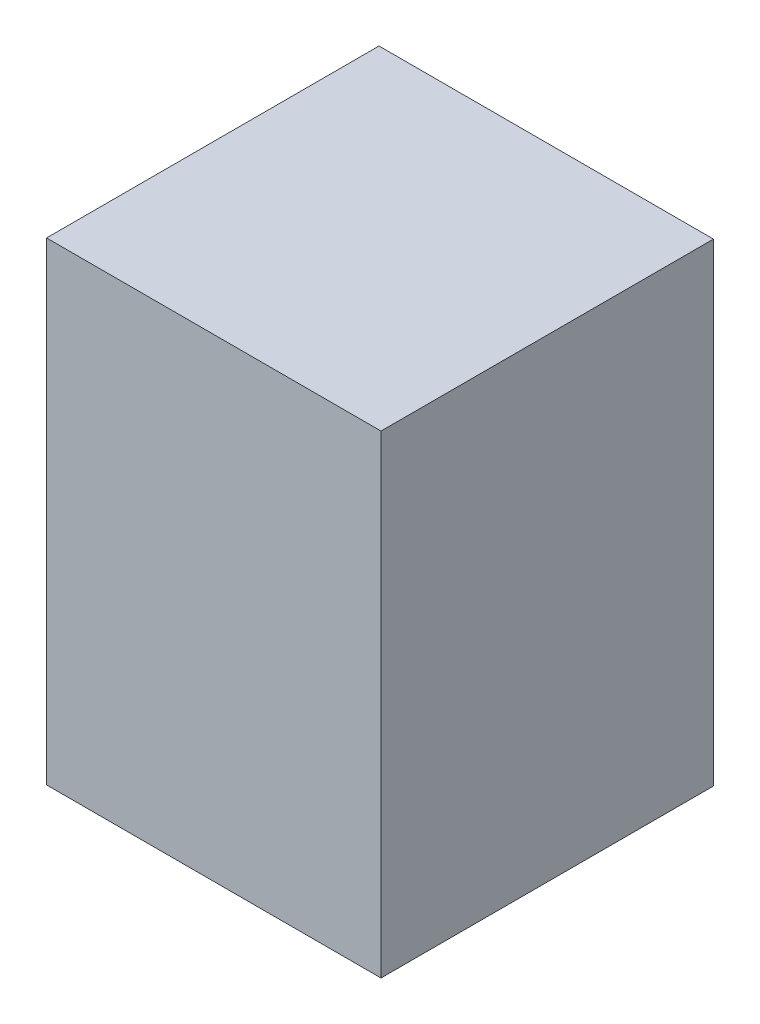
ISO-10303-21;
HEADER;
FILE_DESCRIPTION(('STEP AP214'),'2;1');
FILE_NAME('part.step','',(''),(''),'','','');
FILE_SCHEMA(('AUTOMOTIVE_DESIGN { 1 0 10303 214 1 1 1 1 }'));
ENDSEC;
DATA;
#1=APPLICATION_CONTEXT('core data for automotive mechanical design processes');
#2=APPLICATION_PROTOCOL_DEFINITION('international standard','automotive_design',2000,#1);
#3=PRODUCT_CONTEXT('',#1,'mechanical');
#4=PRODUCT('Part','Part','',(#3));
#5=PRODUCT_RELATED_PRODUCT_CATEGORY('part','',(#4));
#6=PRODUCT_DEFINITION_FORMATION('','',#4);
#7=PRODUCT_DEFINITION_CONTEXT('part definition',#1,'design');
#8=PRODUCT_DEFINITION('design','',#6,#7);
#9=PRODUCT_DEFINITION_SHAPE('','',#8);
#10=(LENGTH_UNIT() NAMED_UNIT(*) SI_UNIT(.MILLI.,.METRE.));
#11=(NAMED_UNIT(*) PLANE_ANGLE_UNIT() SI_UNIT($,.RADIAN.));
#12=(NAMED_UNIT(*) SI_UNIT($,.STERADIAN.) SOLID_ANGLE_UNIT());
#13=UNCERTAINTY_MEASURE_WITH_UNIT(LENGTH_MEASURE(1.E-05),#10,'distance_accuracy_value','');
#14=(GEOMETRIC_REPRESENTATION_CONTEXT(3) GLOBAL_UNCERTAINTY_ASSIGNED_CONTEXT((#13)) GLOBAL_UNIT_ASSIGNED_CONTEXT((#10,
#11,#12)) REPRESENTATION_CONTEXT('',''));
#15=CARTESIAN_POINT('',(0.,0.,0.));
#16=DIRECTION('',(0.,0.,1.));
#17=DIRECTION('',(1.,0.,0.));
#18=AXIS2_PLACEMENT_3D('',#15,#16,#17);
#19=CARTESIAN_POINT('',(-0.4023995,0.56994298,0.80000094));
#20=DIRECTION('',(0.,0.,-1.));
#21=DIRECTION('',(0.,-1.,0.));
#22=AXIS2_PLACEMENT_3D('',#19,#20,#21);
#23=PLANE('',#22);
#24=DIRECTION('',(0.,-1.,0.));
#25=VECTOR('',#24,1.);
#26=CARTESIAN_POINT('',(-0.4023995,0.56994298,0.80000094));
#27=LINE('',#26,#25);
#28=CARTESIAN_POINT('',(-0.4023995,0.56994298,0.80000094));
#29=VERTEX_POINT('',#28);
#30=CARTESIAN_POINT('',(-0.4023995,-0.56994298,0.80000094));
#31=VERTEX_POINT('',#30);
#32=EDGE_CURVE('E90',#29,#31,#27,.T.);
#33=ORIENTED_EDGE('',*,*,#32,.T.);
#34=DIRECTION('',(1.,0.,0.));
#35=VECTOR('',#34,1.);
#36=CARTESIAN_POINT('',(-0.4023995,-0.56994298,0.80000094));
#37=LINE('',#36,#35);
#38=CARTESIAN_POINT('',(0.4023995,-0.56994298,0.80000094));
#39=VERTEX_POINT('',#38);
#40=EDGE_CURVE('E85',#31,#39,#37,.T.);
#41=ORIENTED_EDGE('',*,*,#40,.T.);
#42=DIRECTION('',(0.,1.,0.));
#43=VECTOR('',#42,1.);
#44=CARTESIAN_POINT('',(0.4023995,-0.56994298,0.80000094));
#45=LINE('',#44,#43);
#46=CARTESIAN_POINT('',(0.4023995,0.56994298,0.80000094));
#47=VERTEX_POINT('',#46);
#48=EDGE_CURVE('E19',#39,#47,#45,.T.);
#49=ORIENTED_EDGE('',*,*,#48,.T.);
#50=DIRECTION('',(-1.,0.,0.));
#51=VECTOR('',#50,1.);
#52=CARTESIAN_POINT('',(0.4023995,0.56994298,0.80000094));
#53=LINE('',#52,#51);
#54=EDGE_CURVE('E11',#47,#29,#53,.T.);
#55=ORIENTED_EDGE('',*,*,#54,.T.);
#56=EDGE_LOOP('',(#33,#41,#49,#55));
#57=FACE_BOUND('',#56,.T.);
#58=ADVANCED_FACE('F16',(#57),#23,.F.);
#59=CARTESIAN_POINT('',(-0.4023995,0.56994298,0.));
#60=DIRECTION('',(0.,0.,-1.));
#61=DIRECTION('',(0.,-1.,0.));
#62=AXIS2_PLACEMENT_3D('',#59,#60,#61);
#63=PLANE('',#62);
#64=DIRECTION('',(-1.,0.,0.));
#65=VECTOR('',#64,1.);
#66=CARTESIAN_POINT('',(0.4023995,0.56994298,0.));
#67=LINE('',#66,#65);
#68=CARTESIAN_POINT('',(0.4023995,0.56994298,0.));
#69=VERTEX_POINT('',#68);
#70=CARTESIAN_POINT('',(-0.4023995,0.56994298,0.));
#71=VERTEX_POINT('',#70);
#72=EDGE_CURVE('E26',#69,#71,#67,.T.);
#73=ORIENTED_EDGE('',*,*,#72,.F.);
#74=DIRECTION('',(0.,1.,0.));
#75=VECTOR('',#74,1.);
#76=CARTESIAN_POINT('',(0.4023995,-0.56994298,0.));
#77=LINE('',#76,#75);
#78=CARTESIAN_POINT('',(0.4023995,-0.56994298,0.));
#79=VERTEX_POINT('',#78);
#80=EDGE_CURVE('E73',#79,#69,#77,.T.);
#81=ORIENTED_EDGE('',*,*,#80,.F.);
#82=DIRECTION('',(1.,0.,0.));
#83=VECTOR('',#82,1.);
#84=CARTESIAN_POINT('',(-0.4023995,-0.56994298,0.));
#85=LINE('',#84,#83);
#86=CARTESIAN_POINT('',(-0.4023995,-0.56994298,0.));
#87=VERTEX_POINT('',#86);
#88=EDGE_CURVE('E67',#87,#79,#85,.T.);
#89=ORIENTED_EDGE('',*,*,#88,.F.);
#90=DIRECTION('',(0.,-1.,0.));
#91=VECTOR('',#90,1.);
#92=CARTESIAN_POINT('',(-0.4023995,0.56994298,0.));
#93=LINE('',#92,#91);
#94=EDGE_CURVE('E71',#71,#87,#93,.T.);
#95=ORIENTED_EDGE('',*,*,#94,.F.);
#96=EDGE_LOOP('',(#73,#81,#89,#95));
#97=FACE_BOUND('',#96,.T.);
#98=ADVANCED_FACE('F69',(#97),#63,.T.);
#99=CARTESIAN_POINT('',(0.4023995,0.56994298,0.));
#100=DIRECTION('',(0.,-1.,0.));
#101=DIRECTION('',(0.,0.,-1.));
#102=AXIS2_PLACEMENT_3D('',#99,#100,#101);
#103=PLANE('',#102);
#104=ORIENTED_EDGE('',*,*,#72,.T.);
#105=DIRECTION('',(0.,0.,1.));
#106=VECTOR('',#105,1.);
#107=CARTESIAN_POINT('',(-0.4023995,0.56994298,0.));
#108=LINE('',#107,#106);
#109=EDGE_CURVE('E79',#71,#29,#108,.T.);
#110=ORIENTED_EDGE('',*,*,#109,.T.);
#111=ORIENTED_EDGE('',*,*,#54,.F.);
#112=DIRECTION('',(0.,0.,1.));
#113=VECTOR('',#112,1.);
#114=CARTESIAN_POINT('',(0.4023995,0.56994298,0.));
#115=LINE('',#114,#113);
#116=EDGE_CURVE('E100',#69,#47,#115,.T.);
#117=ORIENTED_EDGE('',*,*,#116,.F.);
#118=EDGE_LOOP('',(#104,#110,#111,#117));
#119=FACE_BOUND('',#118,.T.);
#120=ADVANCED_FACE('F122',(#119),#103,.F.);
#121=CARTESIAN_POINT('',(0.4023995,-0.56994298,0.));
#122=DIRECTION('',(-1.,0.,0.));
#123=DIRECTION('',(0.,0.,1.));
#124=AXIS2_PLACEMENT_3D('',#121,#122,#123);
#125=PLANE('',#124);
#126=ORIENTED_EDGE('',*,*,#80,.T.);
#127=ORIENTED_EDGE('',*,*,#116,.T.);
#128=ORIENTED_EDGE('',*,*,#48,.F.);
#129=DIRECTION('',(0.,0.,1.));
#130=VECTOR('',#129,1.);
#131=CARTESIAN_POINT('',(0.4023995,-0.56994298,0.));
#132=LINE('',#131,#130);
#133=EDGE_CURVE('E78',#79,#39,#132,.T.);
#134=ORIENTED_EDGE('',*,*,#133,.F.);
#135=EDGE_LOOP('',(#126,#127,#128,#134));
#136=FACE_BOUND('',#135,.T.);
#137=ADVANCED_FACE('F120',(#136),#125,.F.);
#138=CARTESIAN_POINT('',(-0.4023995,-0.56994298,0.));
#139=DIRECTION('',(0.,1.,0.));
#140=DIRECTION('',(1.,0.,0.));
#141=AXIS2_PLACEMENT_3D('',#138,#139,#140);
#142=PLANE('',#141);
#143=ORIENTED_EDGE('',*,*,#88,.T.);
#144=ORIENTED_EDGE('',*,*,#133,.T.);
#145=ORIENTED_EDGE('',*,*,#40,.F.);
#146=DIRECTION('',(0.,0.,1.));
#147=VECTOR('',#146,1.);
#148=CARTESIAN_POINT('',(-0.4023995,-0.56994298,0.));
#149=LINE('',#148,#147);
#150=EDGE_CURVE('E82',#87,#31,#149,.T.);
#151=ORIENTED_EDGE('',*,*,#150,.F.);
#152=EDGE_LOOP('',(#143,#144,#145,#151));
#153=FACE_BOUND('',#152,.T.);
#154=ADVANCED_FACE('F83',(#153),#142,.F.);
#155=CARTESIAN_POINT('',(-0.4023995,0.56994298,0.));
#156=DIRECTION('',(1.,0.,0.));
#157=DIRECTION('',(0.,1.,0.));
#158=AXIS2_PLACEMENT_3D('',#155,#156,#157);
#159=PLANE('',#158);
#160=ORIENTED_EDGE('',*,*,#94,.T.);
#161=ORIENTED_EDGE('',*,*,#150,.T.);
#162=ORIENTED_EDGE('',*,*,#32,.F.);
#163=ORIENTED_EDGE('',*,*,#109,.F.);
#164=EDGE_LOOP('',(#160,#161,#162,#163));
#165=FACE_BOUND('',#164,.T.);
#166=ADVANCED_FACE('F92',(#165),#159,.F.);
#167=CLOSED_SHELL('',(#58,#98,#120,#137,#154,#166));
#168=MANIFOLD_SOLID_BREP('B1',#167);
#169=ADVANCED_BREP_SHAPE_REPRESENTATION('',(#18,#168),#14);
#170=SHAPE_DEFINITION_REPRESENTATION(#9,#169);
ENDSEC;
END-ISO-10303-21;
